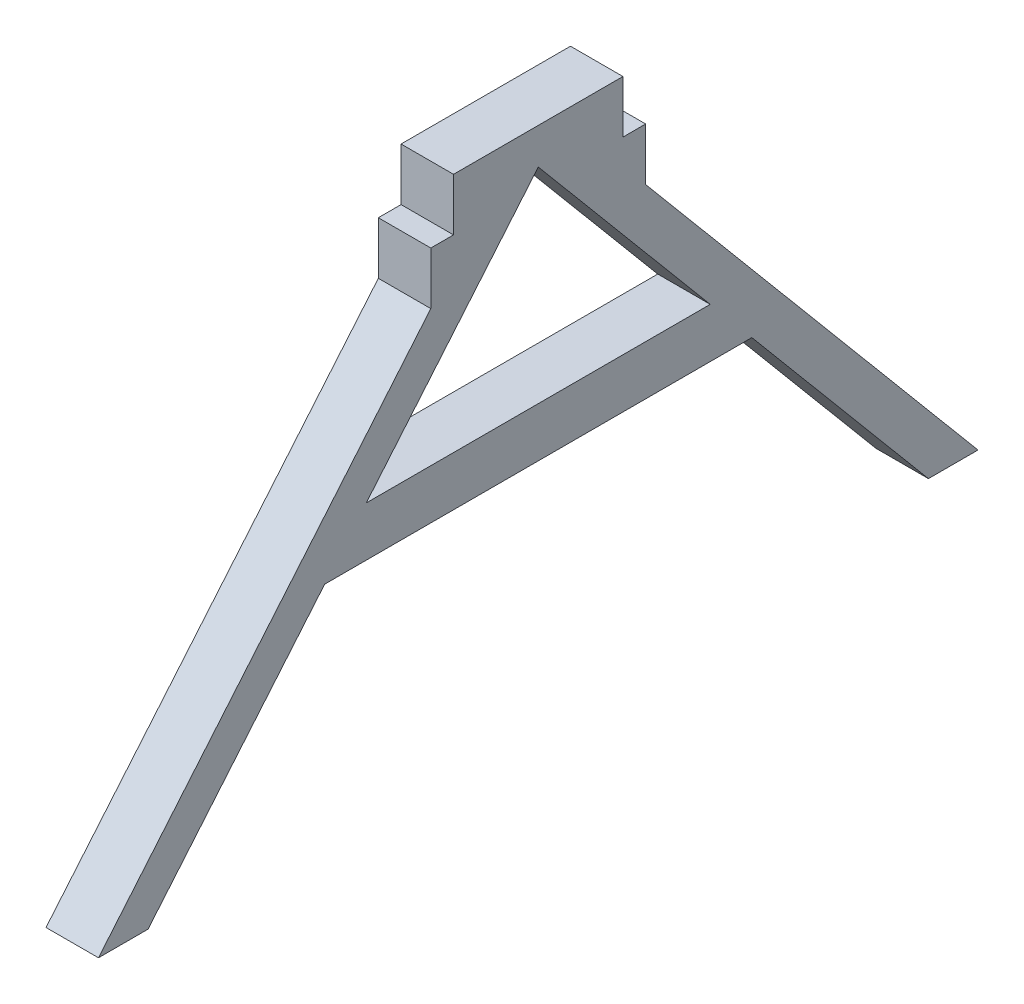
ISO-10303-21;
HEADER;
FILE_DESCRIPTION(('STEP AP214'),'2;1');
FILE_NAME('part.step','',(''),(''),'','','');
FILE_SCHEMA(('AUTOMOTIVE_DESIGN { 1 0 10303 214 1 1 1 1 }'));
ENDSEC;
DATA;
#1=APPLICATION_CONTEXT('core data for automotive mechanical design processes');
#2=APPLICATION_PROTOCOL_DEFINITION('international standard','automotive_design',2000,#1);
#3=PRODUCT_CONTEXT('',#1,'mechanical');
#4=PRODUCT('Part','Part','',(#3));
#5=PRODUCT_RELATED_PRODUCT_CATEGORY('part','',(#4));
#6=PRODUCT_DEFINITION_FORMATION('','',#4);
#7=PRODUCT_DEFINITION_CONTEXT('part definition',#1,'design');
#8=PRODUCT_DEFINITION('design','',#6,#7);
#9=PRODUCT_DEFINITION_SHAPE('','',#8);
#10=(LENGTH_UNIT() NAMED_UNIT(*) SI_UNIT(.MILLI.,.METRE.));
#11=(NAMED_UNIT(*) PLANE_ANGLE_UNIT() SI_UNIT($,.RADIAN.));
#12=(NAMED_UNIT(*) SI_UNIT($,.STERADIAN.) SOLID_ANGLE_UNIT());
#13=UNCERTAINTY_MEASURE_WITH_UNIT(LENGTH_MEASURE(1.E-05),#10,'distance_accuracy_value','');
#14=(GEOMETRIC_REPRESENTATION_CONTEXT(3) GLOBAL_UNCERTAINTY_ASSIGNED_CONTEXT((#13)) GLOBAL_UNIT_ASSIGNED_CONTEXT((#10,
#11,#12)) REPRESENTATION_CONTEXT('',''));
#15=CARTESIAN_POINT('',(0.,0.,0.));
#16=DIRECTION('',(0.,0.,1.));
#17=DIRECTION('',(1.,0.,0.));
#18=AXIS2_PLACEMENT_3D('',#15,#16,#17);
#19=CARTESIAN_POINT('',(3.175,0.,0.));
#20=DIRECTION('',(-1.,0.,0.));
#21=DIRECTION('',(0.,0.,1.));
#22=AXIS2_PLACEMENT_3D('',#19,#20,#21);
#23=PLANE('',#22);
#24=DIRECTION('',(0.,-1.,0.));
#25=VECTOR('',#24,1.);
#26=CARTESIAN_POINT('',(3.175,-2.32123696111085,-2.10254557673263));
#27=LINE('',#26,#25);
#28=CARTESIAN_POINT('',(3.175,0.853763038889148,-2.10254557673263));
#29=VERTEX_POINT('',#28);
#30=CARTESIAN_POINT('',(3.175,-2.32123696111085,-2.10254557673263));
#31=VERTEX_POINT('',#30);
#32=EDGE_CURVE('E195',#29,#31,#27,.T.);
#33=ORIENTED_EDGE('',*,*,#32,.T.);
#34=DIRECTION('',(0.,0.,1.));
#35=VECTOR('',#34,1.);
#36=CARTESIAN_POINT('',(3.175,-2.32123696111085,-2.10254557673263));
#37=LINE('',#36,#35);
#38=CARTESIAN_POINT('',(3.175,-2.32123696111085,-0.727545576732627));
#39=VERTEX_POINT('',#38);
#40=EDGE_CURVE('E199',#31,#39,#37,.T.);
#41=ORIENTED_EDGE('',*,*,#40,.T.);
#42=DIRECTION('',(0.,-1.,0.));
#43=VECTOR('',#42,1.);
#44=CARTESIAN_POINT('',(3.175,-2.32123696111085,-0.727545576732627));
#45=LINE('',#44,#43);
#46=CARTESIAN_POINT('',(3.175,-5.49623696111085,-0.727545576732627));
#47=VERTEX_POINT('',#46);
#48=EDGE_CURVE('E203',#39,#47,#45,.T.);
#49=ORIENTED_EDGE('',*,*,#48,.T.);
#50=DIRECTION('',(0.,-0.766044443118979,0.642787609686538));
#51=VECTOR('',#50,1.);
#52=CARTESIAN_POINT('',(3.175,-5.49623696111085,-0.727545576732627));
#53=LINE('',#52,#51);
#54=CARTESIAN_POINT('',(3.175,-29.4591670084239,19.3797401878947));
#55=VERTEX_POINT('',#54);
#56=EDGE_CURVE('E206',#47,#55,#53,.T.);
#57=ORIENTED_EDGE('',*,*,#56,.T.);
#58=DIRECTION('',(0.,0.,-1.));
#59=VECTOR('',#58,1.);
#60=CARTESIAN_POINT('',(3.175,-29.4591670084239,19.3797401878947));
#61=LINE('',#60,#59);
#62=CARTESIAN_POINT('',(3.175,-29.4591670084239,16.3797401878947));
#63=VERTEX_POINT('',#62);
#64=EDGE_CURVE('E209',#55,#63,#61,.T.);
#65=ORIENTED_EDGE('',*,*,#64,.T.);
#66=DIRECTION('',(0.,0.766044443118979,-0.642787609686538));
#67=VECTOR('',#66,1.);
#68=CARTESIAN_POINT('',(3.175,-29.4591670084239,16.3797401878947));
#69=LINE('',#68,#67);
#70=CARTESIAN_POINT('',(3.175,-16.7261083191224,5.69543533794317));
#71=VERTEX_POINT('',#70);
#72=EDGE_CURVE('E212',#63,#71,#69,.T.);
#73=ORIENTED_EDGE('',*,*,#72,.T.);
#74=DIRECTION('',(0.,0.,-1.));
#75=VECTOR('',#74,1.);
#76=CARTESIAN_POINT('',(3.175,-16.7261083191224,5.69543533794317));
#77=LINE('',#76,#75);
#78=CARTESIAN_POINT('',(3.175,-16.7261083191224,-20.1505264914084));
#79=VERTEX_POINT('',#78);
#80=EDGE_CURVE('E215',#71,#79,#77,.T.);
#81=ORIENTED_EDGE('',*,*,#80,.T.);
#82=DIRECTION('',(0.,-0.766044443118979,-0.642787609686538));
#83=VECTOR('',#82,1.);
#84=CARTESIAN_POINT('',(3.175,-16.7261083191224,-20.1505264914084));
#85=LINE('',#84,#83);
#86=CARTESIAN_POINT('',(3.175,-29.4591670084239,-30.8348313413599));
#87=VERTEX_POINT('',#86);
#88=EDGE_CURVE('E218',#79,#87,#85,.T.);
#89=ORIENTED_EDGE('',*,*,#88,.T.);
#90=DIRECTION('',(0.,0.,-1.));
#91=VECTOR('',#90,1.);
#92=CARTESIAN_POINT('',(3.175,-29.4591670084239,-30.8348313413599));
#93=LINE('',#92,#91);
#94=CARTESIAN_POINT('',(3.175,-29.4591670084239,-33.8348313413599));
#95=VERTEX_POINT('',#94);
#96=EDGE_CURVE('E221',#87,#95,#93,.T.);
#97=ORIENTED_EDGE('',*,*,#96,.T.);
#98=DIRECTION('',(0.,0.766044443118979,0.642787609686538));
#99=VECTOR('',#98,1.);
#100=CARTESIAN_POINT('',(3.175,-29.4591670084239,-33.8348313413599));
#101=LINE('',#100,#99);
#102=CARTESIAN_POINT('',(3.175,-5.49623696111085,-13.7275455767326));
#103=VERTEX_POINT('',#102);
#104=EDGE_CURVE('E224',#95,#103,#101,.T.);
#105=ORIENTED_EDGE('',*,*,#104,.T.);
#106=DIRECTION('',(0.,1.,0.));
#107=VECTOR('',#106,1.);
#108=CARTESIAN_POINT('',(3.175,-2.32123696111085,-13.7275455767326));
#109=LINE('',#108,#107);
#110=CARTESIAN_POINT('',(3.175,-2.32123696111085,-13.7275455767326));
#111=VERTEX_POINT('',#110);
#112=EDGE_CURVE('E227',#103,#111,#109,.T.);
#113=ORIENTED_EDGE('',*,*,#112,.T.);
#114=DIRECTION('',(0.,0.,1.));
#115=VECTOR('',#114,1.);
#116=CARTESIAN_POINT('',(3.175,-2.32123696111085,-12.3525455767326));
#117=LINE('',#116,#115);
#118=CARTESIAN_POINT('',(3.175,-2.32123696111085,-12.3525455767326));
#119=VERTEX_POINT('',#118);
#120=EDGE_CURVE('E230',#111,#119,#117,.T.);
#121=ORIENTED_EDGE('',*,*,#120,.T.);
#122=DIRECTION('',(0.,1.,0.));
#123=VECTOR('',#122,1.);
#124=CARTESIAN_POINT('',(3.175,0.853763038889148,-12.3525455767326));
#125=LINE('',#124,#123);
#126=CARTESIAN_POINT('',(3.175,0.853763038889148,-12.3525455767326));
#127=VERTEX_POINT('',#126);
#128=EDGE_CURVE('E233',#119,#127,#125,.T.);
#129=ORIENTED_EDGE('',*,*,#128,.T.);
#130=DIRECTION('',(0.,0.,1.));
#131=VECTOR('',#130,1.);
#132=CARTESIAN_POINT('',(3.175,0.853763038889148,-2.10254557673263));
#133=LINE('',#132,#131);
#134=EDGE_CURVE('E236',#127,#29,#133,.T.);
#135=ORIENTED_EDGE('',*,*,#134,.T.);
#136=EDGE_LOOP('',(#33,#41,#49,#57,#65,#73,#81,#89,#97,#105,#113,#121,#129,#135));
#137=FACE_BOUND('',#136,.T.);
#138=DIRECTION('',(0.,-0.766044443118979,0.642787609686538));
#139=VECTOR('',#138,1.);
#140=CARTESIAN_POINT('',(3.175,-13.7261083191224,3.17813644441135));
#141=LINE('',#140,#139);
#142=CARTESIAN_POINT('',(3.175,-1.32509938703107,-7.22754557673263));
#143=VERTEX_POINT('',#142);
#144=CARTESIAN_POINT('',(3.175,-13.7261083191224,3.17813644441135));
#145=VERTEX_POINT('',#144);
#146=EDGE_CURVE('E159',#143,#145,#141,.T.);
#147=ORIENTED_EDGE('',*,*,#146,.F.);
#148=DIRECTION('',(0.,0.766044443118979,0.642787609686538));
#149=VECTOR('',#148,1.);
#150=CARTESIAN_POINT('',(3.175,-1.32509938703107,-7.22754557673263));
#151=LINE('',#150,#149);
#152=CARTESIAN_POINT('',(3.175,-13.7261083191224,-17.6332275978766));
#153=VERTEX_POINT('',#152);
#154=EDGE_CURVE('E178',#153,#143,#151,.T.);
#155=ORIENTED_EDGE('',*,*,#154,.F.);
#156=DIRECTION('',(0.,0.,-1.));
#157=VECTOR('',#156,1.);
#158=CARTESIAN_POINT('',(3.175,-13.7261083191224,3.17813644441135));
#159=LINE('',#158,#157);
#160=EDGE_CURVE('E168',#145,#153,#159,.T.);
#161=ORIENTED_EDGE('',*,*,#160,.F.);
#162=EDGE_LOOP('',(#147,#155,#161));
#163=FACE_BOUND('',#162,.T.);
#164=ADVANCED_FACE('F39',(#137,#163),#23,.F.);
#165=CARTESIAN_POINT('',(0.,0.,0.));
#166=DIRECTION('',(-1.,0.,0.));
#167=DIRECTION('',(0.,0.,1.));
#168=AXIS2_PLACEMENT_3D('',#165,#166,#167);
#169=PLANE('',#168);
#170=DIRECTION('',(0.,-1.,0.));
#171=VECTOR('',#170,1.);
#172=CARTESIAN_POINT('',(0.,-2.32123696111085,-2.10254557673263));
#173=LINE('',#172,#171);
#174=CARTESIAN_POINT('',(0.,0.853763038889148,-2.10254557673263));
#175=VERTEX_POINT('',#174);
#176=CARTESIAN_POINT('',(0.,-2.32123696111085,-2.10254557673263));
#177=VERTEX_POINT('',#176);
#178=EDGE_CURVE('E176',#175,#177,#173,.T.);
#179=ORIENTED_EDGE('',*,*,#178,.F.);
#180=DIRECTION('',(0.,0.,1.));
#181=VECTOR('',#180,1.);
#182=CARTESIAN_POINT('',(0.,0.853763038889148,-2.10254557673263));
#183=LINE('',#182,#181);
#184=CARTESIAN_POINT('',(0.,0.853763038889148,-12.3525455767326));
#185=VERTEX_POINT('',#184);
#186=EDGE_CURVE('E200',#185,#175,#183,.T.);
#187=ORIENTED_EDGE('',*,*,#186,.F.);
#188=DIRECTION('',(0.,1.,0.));
#189=VECTOR('',#188,1.);
#190=CARTESIAN_POINT('',(0.,0.853763038889148,-12.3525455767326));
#191=LINE('',#190,#189);
#192=CARTESIAN_POINT('',(0.,-2.32123696111085,-12.3525455767326));
#193=VERTEX_POINT('',#192);
#194=EDGE_CURVE('E276',#193,#185,#191,.T.);
#195=ORIENTED_EDGE('',*,*,#194,.F.);
#196=DIRECTION('',(0.,0.,1.));
#197=VECTOR('',#196,1.);
#198=CARTESIAN_POINT('',(0.,-2.32123696111085,-12.3525455767326));
#199=LINE('',#198,#197);
#200=CARTESIAN_POINT('',(0.,-2.32123696111085,-13.7275455767326));
#201=VERTEX_POINT('',#200);
#202=EDGE_CURVE('E273',#201,#193,#199,.T.);
#203=ORIENTED_EDGE('',*,*,#202,.F.);
#204=DIRECTION('',(0.,1.,0.));
#205=VECTOR('',#204,1.);
#206=CARTESIAN_POINT('',(0.,-2.32123696111085,-13.7275455767326));
#207=LINE('',#206,#205);
#208=CARTESIAN_POINT('',(0.,-5.49623696111085,-13.7275455767326));
#209=VERTEX_POINT('',#208);
#210=EDGE_CURVE('E270',#209,#201,#207,.T.);
#211=ORIENTED_EDGE('',*,*,#210,.F.);
#212=DIRECTION('',(0.,0.766044443118979,0.642787609686538));
#213=VECTOR('',#212,1.);
#214=CARTESIAN_POINT('',(0.,-29.4591670084239,-33.8348313413599));
#215=LINE('',#214,#213);
#216=CARTESIAN_POINT('',(0.,-29.4591670084239,-33.8348313413599));
#217=VERTEX_POINT('',#216);
#218=EDGE_CURVE('E267',#217,#209,#215,.T.);
#219=ORIENTED_EDGE('',*,*,#218,.F.);
#220=DIRECTION('',(0.,0.,-1.));
#221=VECTOR('',#220,1.);
#222=CARTESIAN_POINT('',(0.,-29.4591670084239,-30.8348313413599));
#223=LINE('',#222,#221);
#224=CARTESIAN_POINT('',(0.,-29.4591670084239,-30.8348313413599));
#225=VERTEX_POINT('',#224);
#226=EDGE_CURVE('E264',#225,#217,#223,.T.);
#227=ORIENTED_EDGE('',*,*,#226,.F.);
#228=DIRECTION('',(0.,-0.766044443118979,-0.642787609686538));
#229=VECTOR('',#228,1.);
#230=CARTESIAN_POINT('',(0.,-16.7261083191224,-20.1505264914084));
#231=LINE('',#230,#229);
#232=CARTESIAN_POINT('',(0.,-16.7261083191224,-20.1505264914084));
#233=VERTEX_POINT('',#232);
#234=EDGE_CURVE('E261',#233,#225,#231,.T.);
#235=ORIENTED_EDGE('',*,*,#234,.F.);
#236=DIRECTION('',(0.,0.,-1.));
#237=VECTOR('',#236,1.);
#238=CARTESIAN_POINT('',(0.,-16.7261083191224,5.69543533794317));
#239=LINE('',#238,#237);
#240=CARTESIAN_POINT('',(0.,-16.7261083191224,5.69543533794317));
#241=VERTEX_POINT('',#240);
#242=EDGE_CURVE('E258',#241,#233,#239,.T.);
#243=ORIENTED_EDGE('',*,*,#242,.F.);
#244=DIRECTION('',(0.,0.766044443118979,-0.642787609686538));
#245=VECTOR('',#244,1.);
#246=CARTESIAN_POINT('',(0.,-29.4591670084239,16.3797401878947));
#247=LINE('',#246,#245);
#248=CARTESIAN_POINT('',(0.,-29.4591670084239,16.3797401878947));
#249=VERTEX_POINT('',#248);
#250=EDGE_CURVE('E255',#249,#241,#247,.T.);
#251=ORIENTED_EDGE('',*,*,#250,.F.);
#252=DIRECTION('',(0.,0.,-1.));
#253=VECTOR('',#252,1.);
#254=CARTESIAN_POINT('',(0.,-29.4591670084239,19.3797401878947));
#255=LINE('',#254,#253);
#256=CARTESIAN_POINT('',(0.,-29.4591670084239,19.3797401878947));
#257=VERTEX_POINT('',#256);
#258=EDGE_CURVE('E252',#257,#249,#255,.T.);
#259=ORIENTED_EDGE('',*,*,#258,.F.);
#260=DIRECTION('',(0.,-0.766044443118979,0.642787609686538));
#261=VECTOR('',#260,1.);
#262=CARTESIAN_POINT('',(0.,-5.49623696111085,-0.727545576732627));
#263=LINE('',#262,#261);
#264=CARTESIAN_POINT('',(0.,-5.49623696111085,-0.727545576732627));
#265=VERTEX_POINT('',#264);
#266=EDGE_CURVE('E249',#265,#257,#263,.T.);
#267=ORIENTED_EDGE('',*,*,#266,.F.);
#268=DIRECTION('',(0.,-1.,0.));
#269=VECTOR('',#268,1.);
#270=CARTESIAN_POINT('',(0.,-2.32123696111085,-0.727545576732627));
#271=LINE('',#270,#269);
#272=CARTESIAN_POINT('',(0.,-2.32123696111085,-0.727545576732627));
#273=VERTEX_POINT('',#272);
#274=EDGE_CURVE('E246',#273,#265,#271,.T.);
#275=ORIENTED_EDGE('',*,*,#274,.F.);
#276=DIRECTION('',(0.,0.,1.));
#277=VECTOR('',#276,1.);
#278=CARTESIAN_POINT('',(0.,-2.32123696111085,-2.10254557673263));
#279=LINE('',#278,#277);
#280=EDGE_CURVE('E243',#177,#273,#279,.T.);
#281=ORIENTED_EDGE('',*,*,#280,.F.);
#282=EDGE_LOOP('',(#179,#187,#195,#203,#211,#219,#227,#235,#243,#251,#259,#267,#275,#281));
#283=FACE_BOUND('',#282,.T.);
#284=DIRECTION('',(0.,0.766044443118979,0.642787609686538));
#285=VECTOR('',#284,1.);
#286=CARTESIAN_POINT('',(0.,-1.32509938703107,-7.22754557673263));
#287=LINE('',#286,#285);
#288=CARTESIAN_POINT('',(0.,-13.7261083191224,-17.6332275978766));
#289=VERTEX_POINT('',#288);
#290=CARTESIAN_POINT('',(0.,-1.32509938703107,-7.22754557673263));
#291=VERTEX_POINT('',#290);
#292=EDGE_CURVE('E169',#289,#291,#287,.T.);
#293=ORIENTED_EDGE('',*,*,#292,.T.);
#294=DIRECTION('',(0.,-0.766044443118979,0.642787609686538));
#295=VECTOR('',#294,1.);
#296=CARTESIAN_POINT('',(0.,-13.7261083191224,3.17813644441135));
#297=LINE('',#296,#295);
#298=CARTESIAN_POINT('',(0.,-13.7261083191224,3.17813644441135));
#299=VERTEX_POINT('',#298);
#300=EDGE_CURVE('E63',#291,#299,#297,.T.);
#301=ORIENTED_EDGE('',*,*,#300,.T.);
#302=DIRECTION('',(0.,0.,-1.));
#303=VECTOR('',#302,1.);
#304=CARTESIAN_POINT('',(0.,-13.7261083191224,3.17813644441135));
#305=LINE('',#304,#303);
#306=EDGE_CURVE('E174',#299,#289,#305,.T.);
#307=ORIENTED_EDGE('',*,*,#306,.T.);
#308=EDGE_LOOP('',(#293,#301,#307));
#309=FACE_BOUND('',#308,.T.);
#310=ADVANCED_FACE('F339',(#283,#309),#169,.T.);
#311=CARTESIAN_POINT('',(3.175,-2.32123696111085,-2.10254557673263));
#312=DIRECTION('',(0.,0.,-1.));
#313=DIRECTION('',(-1.,0.,0.));
#314=AXIS2_PLACEMENT_3D('',#311,#312,#313);
#315=PLANE('',#314);
#316=ORIENTED_EDGE('',*,*,#178,.T.);
#317=DIRECTION('',(-1.,0.,0.));
#318=VECTOR('',#317,1.);
#319=CARTESIAN_POINT('',(3.175,-2.32123696111085,-2.10254557673263));
#320=LINE('',#319,#318);
#321=EDGE_CURVE('E11',#31,#177,#320,.T.);
#322=ORIENTED_EDGE('',*,*,#321,.F.);
#323=ORIENTED_EDGE('',*,*,#32,.F.);
#324=DIRECTION('',(-1.,0.,0.));
#325=VECTOR('',#324,1.);
#326=CARTESIAN_POINT('',(3.175,0.853763038889148,-2.10254557673263));
#327=LINE('',#326,#325);
#328=EDGE_CURVE('E239',#29,#175,#327,.T.);
#329=ORIENTED_EDGE('',*,*,#328,.T.);
#330=EDGE_LOOP('',(#316,#322,#323,#329));
#331=FACE_BOUND('',#330,.T.);
#332=ADVANCED_FACE('F41',(#331),#315,.F.);
#333=CARTESIAN_POINT('',(3.175,-2.32123696111085,-2.10254557673263));
#334=DIRECTION('',(0.,-1.,0.));
#335=DIRECTION('',(0.,0.,-1.));
#336=AXIS2_PLACEMENT_3D('',#333,#334,#335);
#337=PLANE('',#336);
#338=ORIENTED_EDGE('',*,*,#280,.T.);
#339=DIRECTION('',(-1.,0.,0.));
#340=VECTOR('',#339,1.);
#341=CARTESIAN_POINT('',(3.175,-2.32123696111085,-0.727545576732627));
#342=LINE('',#341,#340);
#343=EDGE_CURVE('E48',#39,#273,#342,.T.);
#344=ORIENTED_EDGE('',*,*,#343,.F.);
#345=ORIENTED_EDGE('',*,*,#40,.F.);
#346=ORIENTED_EDGE('',*,*,#321,.T.);
#347=EDGE_LOOP('',(#338,#344,#345,#346));
#348=FACE_BOUND('',#347,.T.);
#349=ADVANCED_FACE('F356',(#348),#337,.F.);
#350=CARTESIAN_POINT('',(3.175,-2.32123696111085,-0.727545576732627));
#351=DIRECTION('',(0.,0.,-1.));
#352=DIRECTION('',(-1.,0.,0.));
#353=AXIS2_PLACEMENT_3D('',#350,#351,#352);
#354=PLANE('',#353);
#355=ORIENTED_EDGE('',*,*,#274,.T.);
#356=DIRECTION('',(-1.,0.,0.));
#357=VECTOR('',#356,1.);
#358=CARTESIAN_POINT('',(3.175,-5.49623696111085,-0.727545576732627));
#359=LINE('',#358,#357);
#360=EDGE_CURVE('E324',#47,#265,#359,.T.);
#361=ORIENTED_EDGE('',*,*,#360,.F.);
#362=ORIENTED_EDGE('',*,*,#48,.F.);
#363=ORIENTED_EDGE('',*,*,#343,.T.);
#364=EDGE_LOOP('',(#355,#361,#362,#363));
#365=FACE_BOUND('',#364,.T.);
#366=ADVANCED_FACE('F333',(#365),#354,.F.);
#367=CARTESIAN_POINT('',(3.175,-5.49623696111085,-0.727545576732627));
#368=DIRECTION('',(0.,-0.642787609686538,-0.766044443118979));
#369=DIRECTION('',(0.,0.76604444311898,-0.642787609686538));
#370=AXIS2_PLACEMENT_3D('',#367,#368,#369);
#371=PLANE('',#370);
#372=ORIENTED_EDGE('',*,*,#266,.T.);
#373=DIRECTION('',(-1.,0.,0.));
#374=VECTOR('',#373,1.);
#375=CARTESIAN_POINT('',(3.175,-29.4591670084239,19.3797401878947));
#376=LINE('',#375,#374);
#377=EDGE_CURVE('E320',#55,#257,#376,.T.);
#378=ORIENTED_EDGE('',*,*,#377,.F.);
#379=ORIENTED_EDGE('',*,*,#56,.F.);
#380=ORIENTED_EDGE('',*,*,#360,.T.);
#381=EDGE_LOOP('',(#372,#378,#379,#380));
#382=FACE_BOUND('',#381,.T.);
#383=ADVANCED_FACE('F345',(#382),#371,.F.);
#384=CARTESIAN_POINT('',(3.175,-29.4591670084239,19.3797401878947));
#385=DIRECTION('',(0.,1.,0.));
#386=DIRECTION('',(0.,0.,1.));
#387=AXIS2_PLACEMENT_3D('',#384,#385,#386);
#388=PLANE('',#387);
#389=ORIENTED_EDGE('',*,*,#258,.T.);
#390=DIRECTION('',(-1.,0.,0.));
#391=VECTOR('',#390,1.);
#392=CARTESIAN_POINT('',(3.175,-29.4591670084239,16.3797401878947));
#393=LINE('',#392,#391);
#394=EDGE_CURVE('E316',#63,#249,#393,.T.);
#395=ORIENTED_EDGE('',*,*,#394,.F.);
#396=ORIENTED_EDGE('',*,*,#64,.F.);
#397=ORIENTED_EDGE('',*,*,#377,.T.);
#398=EDGE_LOOP('',(#389,#395,#396,#397));
#399=FACE_BOUND('',#398,.T.);
#400=ADVANCED_FACE('F349',(#399),#388,.F.);
#401=CARTESIAN_POINT('',(3.175,-29.4591670084239,16.3797401878947));
#402=DIRECTION('',(0.,0.642787609686538,0.766044443118979));
#403=DIRECTION('',(0.,-0.76604444311898,0.642787609686538));
#404=AXIS2_PLACEMENT_3D('',#401,#402,#403);
#405=PLANE('',#404);
#406=ORIENTED_EDGE('',*,*,#250,.T.);
#407=DIRECTION('',(-1.,0.,0.));
#408=VECTOR('',#407,1.);
#409=CARTESIAN_POINT('',(3.175,-16.7261083191224,5.69543533794317));
#410=LINE('',#409,#408);
#411=EDGE_CURVE('E312',#71,#241,#410,.T.);
#412=ORIENTED_EDGE('',*,*,#411,.F.);
#413=ORIENTED_EDGE('',*,*,#72,.F.);
#414=ORIENTED_EDGE('',*,*,#394,.T.);
#415=EDGE_LOOP('',(#406,#412,#413,#414));
#416=FACE_BOUND('',#415,.T.);
#417=ADVANCED_FACE('F399',(#416),#405,.F.);
#418=CARTESIAN_POINT('',(3.175,-16.7261083191224,5.69543533794317));
#419=DIRECTION('',(0.,1.,0.));
#420=DIRECTION('',(0.,0.,1.));
#421=AXIS2_PLACEMENT_3D('',#418,#419,#420);
#422=PLANE('',#421);
#423=ORIENTED_EDGE('',*,*,#242,.T.);
#424=DIRECTION('',(-1.,0.,0.));
#425=VECTOR('',#424,1.);
#426=CARTESIAN_POINT('',(3.175,-16.7261083191224,-20.1505264914084));
#427=LINE('',#426,#425);
#428=EDGE_CURVE('E308',#79,#233,#427,.T.);
#429=ORIENTED_EDGE('',*,*,#428,.F.);
#430=ORIENTED_EDGE('',*,*,#80,.F.);
#431=ORIENTED_EDGE('',*,*,#411,.T.);
#432=EDGE_LOOP('',(#423,#429,#430,#431));
#433=FACE_BOUND('',#432,.T.);
#434=ADVANCED_FACE('F397',(#433),#422,.F.);
#435=CARTESIAN_POINT('',(3.175,-16.7261083191224,-20.1505264914084));
#436=DIRECTION('',(0.,0.642787609686538,-0.766044443118979));
#437=DIRECTION('',(0.,0.76604444311898,0.642787609686538));
#438=AXIS2_PLACEMENT_3D('',#435,#436,#437);
#439=PLANE('',#438);
#440=ORIENTED_EDGE('',*,*,#234,.T.);
#441=DIRECTION('',(-1.,0.,0.));
#442=VECTOR('',#441,1.);
#443=CARTESIAN_POINT('',(3.175,-29.4591670084239,-30.8348313413599));
#444=LINE('',#443,#442);
#445=EDGE_CURVE('E304',#87,#225,#444,.T.);
#446=ORIENTED_EDGE('',*,*,#445,.F.);
#447=ORIENTED_EDGE('',*,*,#88,.F.);
#448=ORIENTED_EDGE('',*,*,#428,.T.);
#449=EDGE_LOOP('',(#440,#446,#447,#448));
#450=FACE_BOUND('',#449,.T.);
#451=ADVANCED_FACE('F392',(#450),#439,.F.);
#452=CARTESIAN_POINT('',(3.175,-29.4591670084239,-30.8348313413599));
#453=DIRECTION('',(0.,1.,0.));
#454=DIRECTION('',(0.,0.,1.));
#455=AXIS2_PLACEMENT_3D('',#452,#453,#454);
#456=PLANE('',#455);
#457=ORIENTED_EDGE('',*,*,#226,.T.);
#458=DIRECTION('',(-1.,0.,0.));
#459=VECTOR('',#458,1.);
#460=CARTESIAN_POINT('',(3.175,-29.4591670084239,-33.8348313413599));
#461=LINE('',#460,#459);
#462=EDGE_CURVE('E300',#95,#217,#461,.T.);
#463=ORIENTED_EDGE('',*,*,#462,.F.);
#464=ORIENTED_EDGE('',*,*,#96,.F.);
#465=ORIENTED_EDGE('',*,*,#445,.T.);
#466=EDGE_LOOP('',(#457,#463,#464,#465));
#467=FACE_BOUND('',#466,.T.);
#468=ADVANCED_FACE('F387',(#467),#456,.F.);
#469=CARTESIAN_POINT('',(3.175,-29.4591670084239,-33.8348313413599));
#470=DIRECTION('',(0.,-0.642787609686538,0.766044443118979));
#471=DIRECTION('',(0.,-0.766044443118979,-0.642787609686538));
#472=AXIS2_PLACEMENT_3D('',#469,#470,#471);
#473=PLANE('',#472);
#474=ORIENTED_EDGE('',*,*,#218,.T.);
#475=DIRECTION('',(-1.,0.,0.));
#476=VECTOR('',#475,1.);
#477=CARTESIAN_POINT('',(3.175,-5.49623696111085,-13.7275455767326));
#478=LINE('',#477,#476);
#479=EDGE_CURVE('E296',#103,#209,#478,.T.);
#480=ORIENTED_EDGE('',*,*,#479,.F.);
#481=ORIENTED_EDGE('',*,*,#104,.F.);
#482=ORIENTED_EDGE('',*,*,#462,.T.);
#483=EDGE_LOOP('',(#474,#480,#481,#482));
#484=FACE_BOUND('',#483,.T.);
#485=ADVANCED_FACE('F383',(#484),#473,.F.);
#486=CARTESIAN_POINT('',(3.175,-2.32123696111085,-13.7275455767326));
#487=DIRECTION('',(0.,0.,1.));
#488=DIRECTION('',(1.,0.,0.));
#489=AXIS2_PLACEMENT_3D('',#486,#487,#488);
#490=PLANE('',#489);
#491=ORIENTED_EDGE('',*,*,#210,.T.);
#492=DIRECTION('',(-1.,0.,0.));
#493=VECTOR('',#492,1.);
#494=CARTESIAN_POINT('',(3.175,-2.32123696111085,-13.7275455767326));
#495=LINE('',#494,#493);
#496=EDGE_CURVE('E292',#111,#201,#495,.T.);
#497=ORIENTED_EDGE('',*,*,#496,.F.);
#498=ORIENTED_EDGE('',*,*,#112,.F.);
#499=ORIENTED_EDGE('',*,*,#479,.T.);
#500=EDGE_LOOP('',(#491,#497,#498,#499));
#501=FACE_BOUND('',#500,.T.);
#502=ADVANCED_FACE('F378',(#501),#490,.F.);
#503=CARTESIAN_POINT('',(3.175,-2.32123696111085,-12.3525455767326));
#504=DIRECTION('',(0.,-1.,0.));
#505=DIRECTION('',(0.,0.,-1.));
#506=AXIS2_PLACEMENT_3D('',#503,#504,#505);
#507=PLANE('',#506);
#508=ORIENTED_EDGE('',*,*,#202,.T.);
#509=DIRECTION('',(-1.,0.,0.));
#510=VECTOR('',#509,1.);
#511=CARTESIAN_POINT('',(3.175,-2.32123696111085,-12.3525455767326));
#512=LINE('',#511,#510);
#513=EDGE_CURVE('E288',#119,#193,#512,.T.);
#514=ORIENTED_EDGE('',*,*,#513,.F.);
#515=ORIENTED_EDGE('',*,*,#120,.F.);
#516=ORIENTED_EDGE('',*,*,#496,.T.);
#517=EDGE_LOOP('',(#508,#514,#515,#516));
#518=FACE_BOUND('',#517,.T.);
#519=ADVANCED_FACE('F372',(#518),#507,.F.);
#520=CARTESIAN_POINT('',(3.175,0.853763038889148,-12.3525455767326));
#521=DIRECTION('',(0.,0.,1.));
#522=DIRECTION('',(1.,0.,0.));
#523=AXIS2_PLACEMENT_3D('',#520,#521,#522);
#524=PLANE('',#523);
#525=ORIENTED_EDGE('',*,*,#194,.T.);
#526=DIRECTION('',(-1.,0.,0.));
#527=VECTOR('',#526,1.);
#528=CARTESIAN_POINT('',(3.175,0.853763038889148,-12.3525455767326));
#529=LINE('',#528,#527);
#530=EDGE_CURVE('E284',#127,#185,#529,.T.);
#531=ORIENTED_EDGE('',*,*,#530,.F.);
#532=ORIENTED_EDGE('',*,*,#128,.F.);
#533=ORIENTED_EDGE('',*,*,#513,.T.);
#534=EDGE_LOOP('',(#525,#531,#532,#533));
#535=FACE_BOUND('',#534,.T.);
#536=ADVANCED_FACE('F368',(#535),#524,.F.);
#537=CARTESIAN_POINT('',(3.175,0.853763038889148,-2.10254557673263));
#538=DIRECTION('',(0.,-1.,0.));
#539=DIRECTION('',(0.,0.,-1.));
#540=AXIS2_PLACEMENT_3D('',#537,#538,#539);
#541=PLANE('',#540);
#542=ORIENTED_EDGE('',*,*,#186,.T.);
#543=ORIENTED_EDGE('',*,*,#328,.F.);
#544=ORIENTED_EDGE('',*,*,#134,.F.);
#545=ORIENTED_EDGE('',*,*,#530,.T.);
#546=EDGE_LOOP('',(#542,#543,#544,#545));
#547=FACE_BOUND('',#546,.T.);
#548=ADVANCED_FACE('F363',(#547),#541,.F.);
#549=CARTESIAN_POINT('',(3.175,-13.7261083191224,3.17813644441135));
#550=DIRECTION('',(0.,-0.642787609686538,-0.766044443118979));
#551=DIRECTION('',(0.,0.766044443118979,-0.642787609686538));
#552=AXIS2_PLACEMENT_3D('',#549,#550,#551);
#553=PLANE('',#552);
#554=ORIENTED_EDGE('',*,*,#300,.F.);
#555=DIRECTION('',(-1.,0.,0.));
#556=VECTOR('',#555,1.);
#557=CARTESIAN_POINT('',(3.175,-1.32509938703107,-7.22754557673263));
#558=LINE('',#557,#556);
#559=EDGE_CURVE('E163',#143,#291,#558,.T.);
#560=ORIENTED_EDGE('',*,*,#559,.F.);
#561=ORIENTED_EDGE('',*,*,#146,.T.);
#562=DIRECTION('',(-1.,0.,0.));
#563=VECTOR('',#562,1.);
#564=CARTESIAN_POINT('',(3.175,-13.7261083191224,3.17813644441135));
#565=LINE('',#564,#563);
#566=EDGE_CURVE('E162',#145,#299,#565,.T.);
#567=ORIENTED_EDGE('',*,*,#566,.T.);
#568=EDGE_LOOP('',(#554,#560,#561,#567));
#569=FACE_BOUND('',#568,.T.);
#570=ADVANCED_FACE('F161',(#569),#553,.T.);
#571=CARTESIAN_POINT('',(3.175,-13.7261083191224,3.17813644441135));
#572=DIRECTION('',(0.,1.,0.));
#573=DIRECTION('',(0.,0.,1.));
#574=AXIS2_PLACEMENT_3D('',#571,#572,#573);
#575=PLANE('',#574);
#576=ORIENTED_EDGE('',*,*,#306,.F.);
#577=ORIENTED_EDGE('',*,*,#566,.F.);
#578=ORIENTED_EDGE('',*,*,#160,.T.);
#579=DIRECTION('',(-1.,0.,0.));
#580=VECTOR('',#579,1.);
#581=CARTESIAN_POINT('',(3.175,-13.7261083191224,-17.6332275978766));
#582=LINE('',#581,#580);
#583=EDGE_CURVE('E55',#153,#289,#582,.T.);
#584=ORIENTED_EDGE('',*,*,#583,.T.);
#585=EDGE_LOOP('',(#576,#577,#578,#584));
#586=FACE_BOUND('',#585,.T.);
#587=ADVANCED_FACE('F172',(#586),#575,.T.);
#588=CARTESIAN_POINT('',(3.175,-1.32509938703107,-7.22754557673263));
#589=DIRECTION('',(0.,-0.642787609686538,0.766044443118979));
#590=DIRECTION('',(0.,-0.76604444311898,-0.642787609686538));
#591=AXIS2_PLACEMENT_3D('',#588,#589,#590);
#592=PLANE('',#591);
#593=ORIENTED_EDGE('',*,*,#292,.F.);
#594=ORIENTED_EDGE('',*,*,#583,.F.);
#595=ORIENTED_EDGE('',*,*,#154,.T.);
#596=ORIENTED_EDGE('',*,*,#559,.T.);
#597=EDGE_LOOP('',(#593,#594,#595,#596));
#598=FACE_BOUND('',#597,.T.);
#599=ADVANCED_FACE('F469',(#598),#592,.T.);
#600=CLOSED_SHELL('',(#164,#310,#332,#349,#366,#383,#400,#417,#434,#451,#468,#485,#502,#519,
#536,#548,#570,#587,#599));
#601=MANIFOLD_SOLID_BREP('B2',#600);
#602=ADVANCED_BREP_SHAPE_REPRESENTATION('',(#18,#601),#14);
#603=SHAPE_DEFINITION_REPRESENTATION(#9,#602);
ENDSEC;
END-ISO-10303-21;
